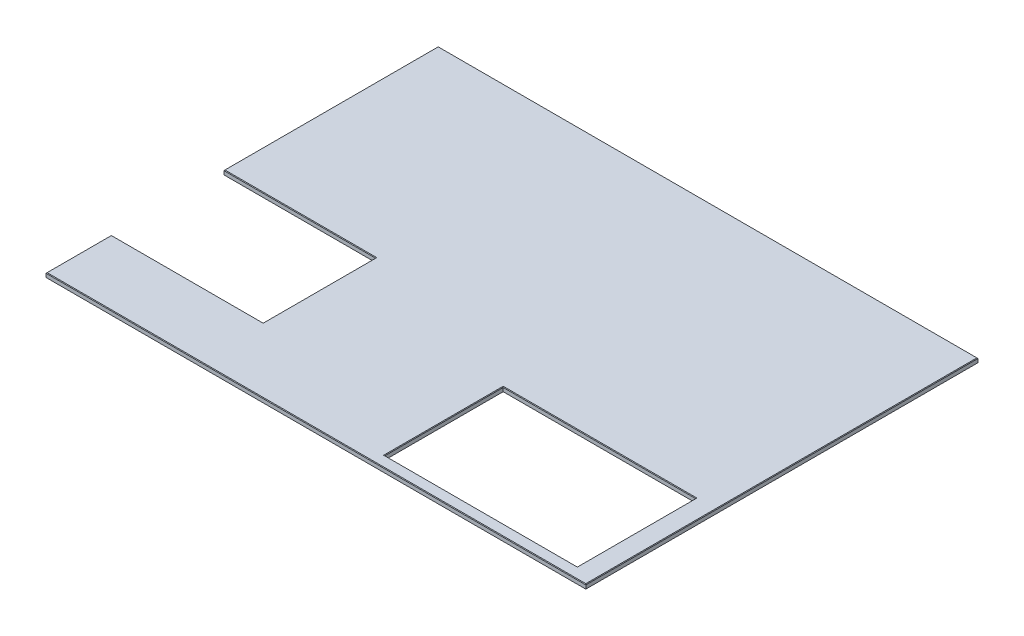
ISO-10303-21;
HEADER;
FILE_DESCRIPTION(('STEP AP214'),'2;1');
FILE_NAME('part.step','',(''),(''),'','','');
FILE_SCHEMA(('AUTOMOTIVE_DESIGN { 1 0 10303 214 1 1 1 1 }'));
ENDSEC;
DATA;
#1=APPLICATION_CONTEXT('core data for automotive mechanical design processes');
#2=APPLICATION_PROTOCOL_DEFINITION('international standard','automotive_design',2000,#1);
#3=PRODUCT_CONTEXT('',#1,'mechanical');
#4=PRODUCT('Part','Part','',(#3));
#5=PRODUCT_RELATED_PRODUCT_CATEGORY('part','',(#4));
#6=PRODUCT_DEFINITION_FORMATION('','',#4);
#7=PRODUCT_DEFINITION_CONTEXT('part definition',#1,'design');
#8=PRODUCT_DEFINITION('design','',#6,#7);
#9=PRODUCT_DEFINITION_SHAPE('','',#8);
#10=(LENGTH_UNIT() NAMED_UNIT(*) SI_UNIT(.MILLI.,.METRE.));
#11=(NAMED_UNIT(*) PLANE_ANGLE_UNIT() SI_UNIT($,.RADIAN.));
#12=(NAMED_UNIT(*) SI_UNIT($,.STERADIAN.) SOLID_ANGLE_UNIT());
#13=UNCERTAINTY_MEASURE_WITH_UNIT(LENGTH_MEASURE(1.E-05),#10,'distance_accuracy_value','');
#14=(GEOMETRIC_REPRESENTATION_CONTEXT(3) GLOBAL_UNCERTAINTY_ASSIGNED_CONTEXT((#13)) GLOBAL_UNIT_ASSIGNED_CONTEXT((#10,
#11,#12)) REPRESENTATION_CONTEXT('',''));
#15=CARTESIAN_POINT('',(0.,0.,0.));
#16=DIRECTION('',(0.,0.,1.));
#17=DIRECTION('',(1.,0.,0.));
#18=AXIS2_PLACEMENT_3D('',#15,#16,#17);
#19=CARTESIAN_POINT('',(0.,-19.05,0.));
#20=DIRECTION('',(0.,0.,1.));
#21=DIRECTION('',(1.,0.,0.));
#22=AXIS2_PLACEMENT_3D('',#19,#20,#21);
#23=PLANE('',#22);
#24=DIRECTION('',(0.,1.,0.));
#25=VECTOR('',#24,1.);
#26=CARTESIAN_POINT('',(2438.4,-19.05,0.));
#27=LINE('',#26,#25);
#28=CARTESIAN_POINT('',(2438.4,-19.05,0.));
#29=VERTEX_POINT('',#28);
#30=CARTESIAN_POINT('',(2438.4,-2.54000000000021,0.));
#31=VERTEX_POINT('',#30);
#32=EDGE_CURVE('E228',#29,#31,#27,.T.);
#33=ORIENTED_EDGE('',*,*,#32,.T.);
#34=DIRECTION('',(-1.,0.,0.));
#35=VECTOR('',#34,1.);
#36=CARTESIAN_POINT('',(0.,-2.54000000000021,0.));
#37=LINE('',#36,#35);
#38=CARTESIAN_POINT('',(0.,-2.54000000000021,0.));
#39=VERTEX_POINT('',#38);
#40=EDGE_CURVE('E293',#31,#39,#37,.T.);
#41=ORIENTED_EDGE('',*,*,#40,.T.);
#42=DIRECTION('',(0.,1.,0.));
#43=VECTOR('',#42,1.);
#44=CARTESIAN_POINT('',(0.,-19.05,0.));
#45=LINE('',#44,#43);
#46=CARTESIAN_POINT('',(0.,-19.05,0.));
#47=VERTEX_POINT('',#46);
#48=EDGE_CURVE('E229',#47,#39,#45,.T.);
#49=ORIENTED_EDGE('',*,*,#48,.F.);
#50=DIRECTION('',(1.,0.,0.));
#51=VECTOR('',#50,1.);
#52=CARTESIAN_POINT('',(0.,-19.05,0.));
#53=LINE('',#52,#51);
#54=EDGE_CURVE('E201',#47,#29,#53,.T.);
#55=ORIENTED_EDGE('',*,*,#54,.T.);
#56=EDGE_LOOP('',(#33,#41,#49,#55));
#57=FACE_BOUND('',#56,.T.);
#58=ADVANCED_FACE('F40',(#57),#23,.T.);
#59=CARTESIAN_POINT('',(1.13148179390222E-13,-19.05,-295.275));
#60=DIRECTION('',(-1.,0.,0.));
#61=DIRECTION('',(0.,0.,1.));
#62=AXIS2_PLACEMENT_3D('',#59,#60,#61);
#63=PLANE('',#62);
#64=ORIENTED_EDGE('',*,*,#48,.T.);
#65=DIRECTION('',(0.,0.,-1.));
#66=VECTOR('',#65,1.);
#67=CARTESIAN_POINT('',(1.13148179390222E-13,-2.54000000000021,-295.275));
#68=LINE('',#67,#66);
#69=CARTESIAN_POINT('',(1.13148179390222E-13,-2.54000000000021,-295.275));
#70=VERTEX_POINT('',#69);
#71=EDGE_CURVE('E278',#39,#70,#68,.T.);
#72=ORIENTED_EDGE('',*,*,#71,.T.);
#73=DIRECTION('',(0.,1.,0.));
#74=VECTOR('',#73,1.);
#75=CARTESIAN_POINT('',(1.13148179390222E-13,-19.05,-295.275));
#76=LINE('',#75,#74);
#77=CARTESIAN_POINT('',(1.13148179390222E-13,-19.05,-295.275));
#78=VERTEX_POINT('',#77);
#79=EDGE_CURVE('E233',#78,#70,#76,.T.);
#80=ORIENTED_EDGE('',*,*,#79,.F.);
#81=DIRECTION('',(0.,0.,1.));
#82=VECTOR('',#81,1.);
#83=CARTESIAN_POINT('',(1.13148179390222E-13,-19.05,-295.275));
#84=LINE('',#83,#82);
#85=EDGE_CURVE('E225',#78,#47,#84,.T.);
#86=ORIENTED_EDGE('',*,*,#85,.T.);
#87=EDGE_LOOP('',(#64,#72,#80,#86));
#88=FACE_BOUND('',#87,.T.);
#89=ADVANCED_FACE('F351',(#88),#63,.T.);
#90=CARTESIAN_POINT('',(1.13148179390222E-13,-19.05,-295.275));
#91=DIRECTION('',(0.,0.,-1.));
#92=DIRECTION('',(-1.,0.,0.));
#93=AXIS2_PLACEMENT_3D('',#90,#91,#92);
#94=PLANE('',#93);
#95=ORIENTED_EDGE('',*,*,#79,.T.);
#96=DIRECTION('',(1.,0.,0.));
#97=VECTOR('',#96,1.);
#98=CARTESIAN_POINT('',(1.13148179390222E-13,-2.54000000000021,-295.275));
#99=LINE('',#98,#97);
#100=CARTESIAN_POINT('',(685.8,-2.54000000000021,-295.275));
#101=VERTEX_POINT('',#100);
#102=EDGE_CURVE('E281',#70,#101,#99,.T.);
#103=ORIENTED_EDGE('',*,*,#102,.T.);
#104=DIRECTION('',(0.,1.,0.));
#105=VECTOR('',#104,1.);
#106=CARTESIAN_POINT('',(685.8,-19.05,-295.275));
#107=LINE('',#106,#105);
#108=CARTESIAN_POINT('',(685.8,-19.05,-295.275));
#109=VERTEX_POINT('',#108);
#110=EDGE_CURVE('E236',#109,#101,#107,.T.);
#111=ORIENTED_EDGE('',*,*,#110,.F.);
#112=DIRECTION('',(-1.,0.,0.));
#113=VECTOR('',#112,1.);
#114=CARTESIAN_POINT('',(1.13148179390222E-13,-19.05,-295.275));
#115=LINE('',#114,#113);
#116=EDGE_CURVE('E222',#109,#78,#115,.T.);
#117=ORIENTED_EDGE('',*,*,#116,.T.);
#118=EDGE_LOOP('',(#95,#103,#111,#117));
#119=FACE_BOUND('',#118,.T.);
#120=ADVANCED_FACE('F358',(#119),#94,.T.);
#121=CARTESIAN_POINT('',(685.8,-19.05,-803.275));
#122=DIRECTION('',(-1.,0.,0.));
#123=DIRECTION('',(0.,0.,1.));
#124=AXIS2_PLACEMENT_3D('',#121,#122,#123);
#125=PLANE('',#124);
#126=ORIENTED_EDGE('',*,*,#110,.T.);
#127=DIRECTION('',(0.,0.,-1.));
#128=VECTOR('',#127,1.);
#129=CARTESIAN_POINT('',(685.8,-2.54000000000021,-803.275));
#130=LINE('',#129,#128);
#131=CARTESIAN_POINT('',(685.8,-2.54000000000021,-803.275));
#132=VERTEX_POINT('',#131);
#133=EDGE_CURVE('E283',#101,#132,#130,.T.);
#134=ORIENTED_EDGE('',*,*,#133,.T.);
#135=DIRECTION('',(0.,1.,0.));
#136=VECTOR('',#135,1.);
#137=CARTESIAN_POINT('',(685.8,-19.05,-803.275));
#138=LINE('',#137,#136);
#139=CARTESIAN_POINT('',(685.8,-19.05,-803.275));
#140=VERTEX_POINT('',#139);
#141=EDGE_CURVE('E239',#140,#132,#138,.T.);
#142=ORIENTED_EDGE('',*,*,#141,.F.);
#143=DIRECTION('',(0.,0.,1.));
#144=VECTOR('',#143,1.);
#145=CARTESIAN_POINT('',(685.8,-19.05,-803.275));
#146=LINE('',#145,#144);
#147=EDGE_CURVE('E219',#140,#109,#146,.T.);
#148=ORIENTED_EDGE('',*,*,#147,.T.);
#149=EDGE_LOOP('',(#126,#134,#142,#148));
#150=FACE_BOUND('',#149,.T.);
#151=ADVANCED_FACE('F555',(#150),#125,.T.);
#152=CARTESIAN_POINT('',(0.,-19.05,-803.275));
#153=DIRECTION('',(0.,0.,1.));
#154=DIRECTION('',(1.,0.,0.));
#155=AXIS2_PLACEMENT_3D('',#152,#153,#154);
#156=PLANE('',#155);
#157=ORIENTED_EDGE('',*,*,#141,.T.);
#158=DIRECTION('',(-1.,0.,0.));
#159=VECTOR('',#158,1.);
#160=CARTESIAN_POINT('',(0.,-2.54000000000021,-803.275));
#161=LINE('',#160,#159);
#162=CARTESIAN_POINT('',(0.,-2.54000000000021,-803.275));
#163=VERTEX_POINT('',#162);
#164=EDGE_CURVE('E285',#132,#163,#161,.T.);
#165=ORIENTED_EDGE('',*,*,#164,.T.);
#166=DIRECTION('',(0.,1.,0.));
#167=VECTOR('',#166,1.);
#168=CARTESIAN_POINT('',(0.,-19.05,-803.275));
#169=LINE('',#168,#167);
#170=CARTESIAN_POINT('',(0.,-19.05,-803.275));
#171=VERTEX_POINT('',#170);
#172=EDGE_CURVE('E242',#171,#163,#169,.T.);
#173=ORIENTED_EDGE('',*,*,#172,.F.);
#174=DIRECTION('',(1.,0.,0.));
#175=VECTOR('',#174,1.);
#176=CARTESIAN_POINT('',(0.,-19.05,-803.275));
#177=LINE('',#176,#175);
#178=EDGE_CURVE('E216',#171,#140,#177,.T.);
#179=ORIENTED_EDGE('',*,*,#178,.T.);
#180=EDGE_LOOP('',(#157,#165,#173,#179));
#181=FACE_BOUND('',#180,.T.);
#182=ADVANCED_FACE('F545',(#181),#156,.T.);
#183=CARTESIAN_POINT('',(0.,-19.05,-1771.65));
#184=DIRECTION('',(-1.,0.,0.));
#185=DIRECTION('',(0.,0.,1.));
#186=AXIS2_PLACEMENT_3D('',#183,#184,#185);
#187=PLANE('',#186);
#188=ORIENTED_EDGE('',*,*,#172,.T.);
#189=DIRECTION('',(0.,0.,-1.));
#190=VECTOR('',#189,1.);
#191=CARTESIAN_POINT('',(0.,-2.54000000000021,-1771.65));
#192=LINE('',#191,#190);
#193=CARTESIAN_POINT('',(0.,-2.54000000000021,-1771.65));
#194=VERTEX_POINT('',#193);
#195=EDGE_CURVE('E287',#163,#194,#192,.T.);
#196=ORIENTED_EDGE('',*,*,#195,.T.);
#197=DIRECTION('',(0.,1.,0.));
#198=VECTOR('',#197,1.);
#199=CARTESIAN_POINT('',(0.,-19.05,-1771.65));
#200=LINE('',#199,#198);
#201=CARTESIAN_POINT('',(0.,-19.05,-1771.65));
#202=VERTEX_POINT('',#201);
#203=EDGE_CURVE('E245',#202,#194,#200,.T.);
#204=ORIENTED_EDGE('',*,*,#203,.F.);
#205=DIRECTION('',(0.,0.,1.));
#206=VECTOR('',#205,1.);
#207=CARTESIAN_POINT('',(0.,-19.05,-1771.65));
#208=LINE('',#207,#206);
#209=EDGE_CURVE('E213',#202,#171,#208,.T.);
#210=ORIENTED_EDGE('',*,*,#209,.T.);
#211=EDGE_LOOP('',(#188,#196,#204,#210));
#212=FACE_BOUND('',#211,.T.);
#213=ADVANCED_FACE('F536',(#212),#187,.T.);
#214=CARTESIAN_POINT('',(2438.4,-19.05,-1771.65));
#215=DIRECTION('',(0.,0.,-1.));
#216=DIRECTION('',(-1.,0.,0.));
#217=AXIS2_PLACEMENT_3D('',#214,#215,#216);
#218=PLANE('',#217);
#219=ORIENTED_EDGE('',*,*,#203,.T.);
#220=DIRECTION('',(1.,0.,0.));
#221=VECTOR('',#220,1.);
#222=CARTESIAN_POINT('',(2438.4,-2.54000000000021,-1771.65));
#223=LINE('',#222,#221);
#224=CARTESIAN_POINT('',(2438.4,-2.54000000000021,-1771.65));
#225=VERTEX_POINT('',#224);
#226=EDGE_CURVE('E289',#194,#225,#223,.T.);
#227=ORIENTED_EDGE('',*,*,#226,.T.);
#228=DIRECTION('',(0.,1.,0.));
#229=VECTOR('',#228,1.);
#230=CARTESIAN_POINT('',(2438.4,-19.05,-1771.65));
#231=LINE('',#230,#229);
#232=CARTESIAN_POINT('',(2438.4,-19.05,-1771.65));
#233=VERTEX_POINT('',#232);
#234=EDGE_CURVE('E248',#233,#225,#231,.T.);
#235=ORIENTED_EDGE('',*,*,#234,.F.);
#236=DIRECTION('',(-1.,0.,0.));
#237=VECTOR('',#236,1.);
#238=CARTESIAN_POINT('',(2438.4,-19.05,-1771.65));
#239=LINE('',#238,#237);
#240=EDGE_CURVE('E210',#233,#202,#239,.T.);
#241=ORIENTED_EDGE('',*,*,#240,.T.);
#242=EDGE_LOOP('',(#219,#227,#235,#241));
#243=FACE_BOUND('',#242,.T.);
#244=ADVANCED_FACE('F527',(#243),#218,.T.);
#245=CARTESIAN_POINT('',(2438.4,-19.05,0.));
#246=DIRECTION('',(1.,0.,0.));
#247=DIRECTION('',(0.,0.,-1.));
#248=AXIS2_PLACEMENT_3D('',#245,#246,#247);
#249=PLANE('',#248);
#250=ORIENTED_EDGE('',*,*,#234,.T.);
#251=DIRECTION('',(0.,0.,1.));
#252=VECTOR('',#251,1.);
#253=CARTESIAN_POINT('',(2438.4,-2.54000000000021,0.));
#254=LINE('',#253,#252);
#255=EDGE_CURVE('E291',#225,#31,#254,.T.);
#256=ORIENTED_EDGE('',*,*,#255,.T.);
#257=ORIENTED_EDGE('',*,*,#32,.F.);
#258=DIRECTION('',(0.,0.,-1.));
#259=VECTOR('',#258,1.);
#260=CARTESIAN_POINT('',(2438.4,-19.05,0.));
#261=LINE('',#260,#259);
#262=EDGE_CURVE('E207',#29,#233,#261,.T.);
#263=ORIENTED_EDGE('',*,*,#262,.T.);
#264=EDGE_LOOP('',(#250,#256,#257,#263));
#265=FACE_BOUND('',#264,.T.);
#266=ADVANCED_FACE('F363',(#265),#249,.T.);
#267=CARTESIAN_POINT('',(0.,-19.05,0.));
#268=DIRECTION('',(0.,1.,0.));
#269=DIRECTION('',(0.,0.,1.));
#270=AXIS2_PLACEMENT_3D('',#267,#268,#269);
#271=PLANE('',#270);
#272=DIRECTION('',(0.,0.,-1.));
#273=VECTOR('',#272,1.);
#274=CARTESIAN_POINT('',(2349.4365,-19.05,-585.724));
#275=LINE('',#274,#273);
#276=CARTESIAN_POINT('',(2349.4365,-19.05,-50.8));
#277=VERTEX_POINT('',#276);
#278=CARTESIAN_POINT('',(2349.4365,-19.05,-585.724));
#279=VERTEX_POINT('',#278);
#280=EDGE_CURVE('E178',#277,#279,#275,.T.);
#281=ORIENTED_EDGE('',*,*,#280,.T.);
#282=DIRECTION('',(-1.,0.,0.));
#283=VECTOR('',#282,1.);
#284=CARTESIAN_POINT('',(1479.4865,-19.05,-585.724));
#285=LINE('',#284,#283);
#286=CARTESIAN_POINT('',(1479.4865,-19.05,-585.724));
#287=VERTEX_POINT('',#286);
#288=EDGE_CURVE('E171',#279,#287,#285,.T.);
#289=ORIENTED_EDGE('',*,*,#288,.T.);
#290=DIRECTION('',(0.,0.,1.));
#291=VECTOR('',#290,1.);
#292=CARTESIAN_POINT('',(1479.4865,-19.05,-50.8));
#293=LINE('',#292,#291);
#294=CARTESIAN_POINT('',(1479.4865,-19.05,-50.8));
#295=VERTEX_POINT('',#294);
#296=EDGE_CURVE('E182',#287,#295,#293,.T.);
#297=ORIENTED_EDGE('',*,*,#296,.T.);
#298=DIRECTION('',(1.,0.,0.));
#299=VECTOR('',#298,1.);
#300=CARTESIAN_POINT('',(1479.4865,-19.05,-50.8));
#301=LINE('',#300,#299);
#302=EDGE_CURVE('E186',#295,#277,#301,.T.);
#303=ORIENTED_EDGE('',*,*,#302,.T.);
#304=EDGE_LOOP('',(#281,#289,#297,#303));
#305=FACE_BOUND('',#304,.T.);
#306=ORIENTED_EDGE('',*,*,#54,.F.);
#307=ORIENTED_EDGE('',*,*,#85,.F.);
#308=ORIENTED_EDGE('',*,*,#116,.F.);
#309=ORIENTED_EDGE('',*,*,#147,.F.);
#310=ORIENTED_EDGE('',*,*,#178,.F.);
#311=ORIENTED_EDGE('',*,*,#209,.F.);
#312=ORIENTED_EDGE('',*,*,#240,.F.);
#313=ORIENTED_EDGE('',*,*,#262,.F.);
#314=EDGE_LOOP('',(#306,#307,#308,#309,#310,#311,#312,#313));
#315=FACE_BOUND('',#314,.T.);
#316=ADVANCED_FACE('F188',(#305,#315),#271,.F.);
#317=CARTESIAN_POINT('',(0.,0.,0.));
#318=DIRECTION('',(0.,1.,0.));
#319=DIRECTION('',(0.,0.,1.));
#320=AXIS2_PLACEMENT_3D('',#317,#318,#319);
#321=PLANE('',#320);
#322=DIRECTION('',(-1.,0.,0.));
#323=VECTOR('',#322,1.);
#324=CARTESIAN_POINT('',(0.,0.,-292.735));
#325=LINE('',#324,#323);
#326=CARTESIAN_POINT('',(688.34,0.,-292.735));
#327=VERTEX_POINT('',#326);
#328=CARTESIAN_POINT('',(2.54000000000032,0.,-292.735));
#329=VERTEX_POINT('',#328);
#330=EDGE_CURVE('E273',#327,#329,#325,.T.);
#331=ORIENTED_EDGE('',*,*,#330,.T.);
#332=DIRECTION('',(0.,0.,1.));
#333=VECTOR('',#332,1.);
#334=CARTESIAN_POINT('',(2.54000000000021,0.,0.));
#335=LINE('',#334,#333);
#336=CARTESIAN_POINT('',(2.54000000000021,0.,-2.54000000000021));
#337=VERTEX_POINT('',#336);
#338=EDGE_CURVE('E275',#329,#337,#335,.T.);
#339=ORIENTED_EDGE('',*,*,#338,.T.);
#340=DIRECTION('',(1.,0.,0.));
#341=VECTOR('',#340,1.);
#342=CARTESIAN_POINT('',(0.,0.,-2.54000000000021));
#343=LINE('',#342,#341);
#344=CARTESIAN_POINT('',(2435.86,0.,-2.54000000000021));
#345=VERTEX_POINT('',#344);
#346=EDGE_CURVE('E261',#337,#345,#343,.T.);
#347=ORIENTED_EDGE('',*,*,#346,.T.);
#348=DIRECTION('',(0.,0.,-1.));
#349=VECTOR('',#348,1.);
#350=CARTESIAN_POINT('',(2435.86,0.,-6.10582870603885E-13));
#351=LINE('',#350,#349);
#352=CARTESIAN_POINT('',(2435.86,0.,-1769.11));
#353=VERTEX_POINT('',#352);
#354=EDGE_CURVE('E263',#345,#353,#351,.T.);
#355=ORIENTED_EDGE('',*,*,#354,.T.);
#356=DIRECTION('',(-1.,0.,0.));
#357=VECTOR('',#356,1.);
#358=CARTESIAN_POINT('',(-1.61097986802379E-13,0.,-1769.11));
#359=LINE('',#358,#357);
#360=CARTESIAN_POINT('',(2.54000000000021,0.,-1769.11));
#361=VERTEX_POINT('',#360);
#362=EDGE_CURVE('E265',#353,#361,#359,.T.);
#363=ORIENTED_EDGE('',*,*,#362,.T.);
#364=DIRECTION('',(0.,0.,1.));
#365=VECTOR('',#364,1.);
#366=CARTESIAN_POINT('',(2.5400000000003,0.,0.));
#367=LINE('',#366,#365);
#368=CARTESIAN_POINT('',(2.54000000000026,0.,-805.815));
#369=VERTEX_POINT('',#368);
#370=EDGE_CURVE('E267',#361,#369,#367,.T.);
#371=ORIENTED_EDGE('',*,*,#370,.T.);
#372=DIRECTION('',(1.,0.,0.));
#373=VECTOR('',#372,1.);
#374=CARTESIAN_POINT('',(0.,0.,-805.815));
#375=LINE('',#374,#373);
#376=CARTESIAN_POINT('',(688.34,0.,-805.815));
#377=VERTEX_POINT('',#376);
#378=EDGE_CURVE('E269',#369,#377,#375,.T.);
#379=ORIENTED_EDGE('',*,*,#378,.T.);
#380=DIRECTION('',(0.,0.,1.));
#381=VECTOR('',#380,1.);
#382=CARTESIAN_POINT('',(688.34,0.,-1.50435219836709E-13));
#383=LINE('',#382,#381);
#384=EDGE_CURVE('E271',#377,#327,#383,.T.);
#385=ORIENTED_EDGE('',*,*,#384,.T.);
#386=EDGE_LOOP('',(#331,#339,#347,#355,#363,#371,#379,#385));
#387=FACE_BOUND('',#386,.T.);
#388=DIRECTION('',(-1.,0.,0.));
#389=VECTOR('',#388,1.);
#390=CARTESIAN_POINT('',(1479.4865,0.,-48.2599999999998));
#391=LINE('',#390,#389);
#392=CARTESIAN_POINT('',(2351.9765,0.,-48.2599999999997));
#393=VERTEX_POINT('',#392);
#394=CARTESIAN_POINT('',(1476.9465,0.,-48.2599999999998));
#395=VERTEX_POINT('',#394);
#396=EDGE_CURVE('E256',#393,#395,#391,.T.);
#397=ORIENTED_EDGE('',*,*,#396,.T.);
#398=DIRECTION('',(0.,0.,-1.));
#399=VECTOR('',#398,1.);
#400=CARTESIAN_POINT('',(1476.9465,0.,-585.724));
#401=LINE('',#400,#399);
#402=CARTESIAN_POINT('',(1476.9465,0.,-588.264));
#403=VERTEX_POINT('',#402);
#404=EDGE_CURVE('E258',#395,#403,#401,.T.);
#405=ORIENTED_EDGE('',*,*,#404,.T.);
#406=DIRECTION('',(1.,0.,0.));
#407=VECTOR('',#406,1.);
#408=CARTESIAN_POINT('',(2349.4365,0.,-588.264));
#409=LINE('',#408,#407);
#410=CARTESIAN_POINT('',(2351.9765,0.,-588.264));
#411=VERTEX_POINT('',#410);
#412=EDGE_CURVE('E232',#403,#411,#409,.T.);
#413=ORIENTED_EDGE('',*,*,#412,.T.);
#414=DIRECTION('',(0.,0.,1.));
#415=VECTOR('',#414,1.);
#416=CARTESIAN_POINT('',(2351.9765,0.,-50.8));
#417=LINE('',#416,#415);
#418=EDGE_CURVE('E254',#411,#393,#417,.T.);
#419=ORIENTED_EDGE('',*,*,#418,.T.);
#420=EDGE_LOOP('',(#397,#405,#413,#419));
#421=FACE_BOUND('',#420,.T.);
#422=ADVANCED_FACE('F333',(#387,#421),#321,.T.);
#423=CARTESIAN_POINT('',(1479.4865,-19.05,-585.724));
#424=DIRECTION('',(0.,0.,-1.));
#425=DIRECTION('',(-1.,0.,0.));
#426=AXIS2_PLACEMENT_3D('',#423,#424,#425);
#427=PLANE('',#426);
#428=DIRECTION('',(0.,1.,0.));
#429=VECTOR('',#428,1.);
#430=CARTESIAN_POINT('',(2349.4365,-19.05,-585.724));
#431=LINE('',#430,#429);
#432=CARTESIAN_POINT('',(2349.4365,-2.54000000000021,-585.724));
#433=VERTEX_POINT('',#432);
#434=EDGE_CURVE('E199',#279,#433,#431,.T.);
#435=ORIENTED_EDGE('',*,*,#434,.T.);
#436=DIRECTION('',(-1.,0.,0.));
#437=VECTOR('',#436,1.);
#438=CARTESIAN_POINT('',(1479.4865,-2.54000000000021,-585.724));
#439=LINE('',#438,#437);
#440=CARTESIAN_POINT('',(1479.4865,-2.54000000000021,-585.724));
#441=VERTEX_POINT('',#440);
#442=EDGE_CURVE('E11',#433,#441,#439,.T.);
#443=ORIENTED_EDGE('',*,*,#442,.T.);
#444=DIRECTION('',(0.,1.,0.));
#445=VECTOR('',#444,1.);
#446=CARTESIAN_POINT('',(1479.4865,-19.05,-585.724));
#447=LINE('',#446,#445);
#448=EDGE_CURVE('E167',#287,#441,#447,.T.);
#449=ORIENTED_EDGE('',*,*,#448,.F.);
#450=ORIENTED_EDGE('',*,*,#288,.F.);
#451=EDGE_LOOP('',(#435,#443,#449,#450));
#452=FACE_BOUND('',#451,.T.);
#453=ADVANCED_FACE('F169',(#452),#427,.F.);
#454=CARTESIAN_POINT('',(2349.4365,-19.05,-585.724));
#455=DIRECTION('',(1.,0.,0.));
#456=DIRECTION('',(0.,0.,-1.));
#457=AXIS2_PLACEMENT_3D('',#454,#455,#456);
#458=PLANE('',#457);
#459=DIRECTION('',(0.,1.,0.));
#460=VECTOR('',#459,1.);
#461=CARTESIAN_POINT('',(2349.4365,-19.05,-50.8));
#462=LINE('',#461,#460);
#463=CARTESIAN_POINT('',(2349.4365,-2.54000000000021,-50.8));
#464=VERTEX_POINT('',#463);
#465=EDGE_CURVE('E202',#277,#464,#462,.T.);
#466=ORIENTED_EDGE('',*,*,#465,.T.);
#467=DIRECTION('',(0.,0.,-1.));
#468=VECTOR('',#467,1.);
#469=CARTESIAN_POINT('',(2349.4365,-2.54000000000021,-585.724));
#470=LINE('',#469,#468);
#471=EDGE_CURVE('E50',#464,#433,#470,.T.);
#472=ORIENTED_EDGE('',*,*,#471,.T.);
#473=ORIENTED_EDGE('',*,*,#434,.F.);
#474=ORIENTED_EDGE('',*,*,#280,.F.);
#475=EDGE_LOOP('',(#466,#472,#473,#474));
#476=FACE_BOUND('',#475,.T.);
#477=ADVANCED_FACE('F341',(#476),#458,.F.);
#478=CARTESIAN_POINT('',(1479.4865,-19.05,-50.8));
#479=DIRECTION('',(0.,0.,1.));
#480=DIRECTION('',(1.,0.,0.));
#481=AXIS2_PLACEMENT_3D('',#478,#479,#480);
#482=PLANE('',#481);
#483=DIRECTION('',(0.,1.,0.));
#484=VECTOR('',#483,1.);
#485=CARTESIAN_POINT('',(1479.4865,-19.05,-50.8));
#486=LINE('',#485,#484);
#487=CARTESIAN_POINT('',(1479.4865,-2.54000000000021,-50.8));
#488=VERTEX_POINT('',#487);
#489=EDGE_CURVE('E177',#295,#488,#486,.T.);
#490=ORIENTED_EDGE('',*,*,#489,.T.);
#491=DIRECTION('',(1.,0.,0.));
#492=VECTOR('',#491,1.);
#493=CARTESIAN_POINT('',(2349.4365,-2.54000000000021,-50.8));
#494=LINE('',#493,#492);
#495=EDGE_CURVE('E65',#488,#464,#494,.T.);
#496=ORIENTED_EDGE('',*,*,#495,.T.);
#497=ORIENTED_EDGE('',*,*,#465,.F.);
#498=ORIENTED_EDGE('',*,*,#302,.F.);
#499=EDGE_LOOP('',(#490,#496,#497,#498));
#500=FACE_BOUND('',#499,.T.);
#501=ADVANCED_FACE('F340',(#500),#482,.F.);
#502=CARTESIAN_POINT('',(1479.4865,-19.05,-50.8));
#503=DIRECTION('',(-1.,0.,0.));
#504=DIRECTION('',(0.,0.,1.));
#505=AXIS2_PLACEMENT_3D('',#502,#503,#504);
#506=PLANE('',#505);
#507=ORIENTED_EDGE('',*,*,#448,.T.);
#508=DIRECTION('',(0.,0.,1.));
#509=VECTOR('',#508,1.);
#510=CARTESIAN_POINT('',(1479.4865,-2.54000000000021,-50.8));
#511=LINE('',#510,#509);
#512=EDGE_CURVE('E295',#441,#488,#511,.T.);
#513=ORIENTED_EDGE('',*,*,#512,.T.);
#514=ORIENTED_EDGE('',*,*,#489,.F.);
#515=ORIENTED_EDGE('',*,*,#296,.F.);
#516=EDGE_LOOP('',(#507,#513,#514,#515));
#517=FACE_BOUND('',#516,.T.);
#518=ADVANCED_FACE('F183',(#517),#506,.F.);
#519=CARTESIAN_POINT('',(2.5400000000003,0.,0.));
#520=DIRECTION('',(0.707106781186547,-0.707106781186547,0.));
#521=DIRECTION('',(0.,0.,1.));
#522=AXIS2_PLACEMENT_3D('',#519,#520,#521);
#523=PLANE('',#522);
#524=DIRECTION('',(0.577350269189643,0.577350269189643,0.577350269189592));
#525=VECTOR('',#524,1.);
#526=CARTESIAN_POINT('',(1.69333333333337,-0.846666666666839,-1769.95666666667));
#527=LINE('',#526,#525);
#528=EDGE_CURVE('E194',#194,#361,#527,.T.);
#529=ORIENTED_EDGE('',*,*,#528,.F.);
#530=ORIENTED_EDGE('',*,*,#195,.F.);
#531=DIRECTION('',(0.577350269189626,0.577350269189626,-0.577350269189626));
#532=VECTOR('',#531,1.);
#533=CARTESIAN_POINT('',(-266.065,-268.605,-537.21));
#534=LINE('',#533,#532);
#535=EDGE_CURVE('E191',#369,#163,#534,.F.);
#536=ORIENTED_EDGE('',*,*,#535,.F.);
#537=ORIENTED_EDGE('',*,*,#370,.F.);
#538=EDGE_LOOP('',(#529,#530,#536,#537));
#539=FACE_BOUND('',#538,.T.);
#540=ADVANCED_FACE('F414',(#539),#523,.F.);
#541=CARTESIAN_POINT('',(0.,0.,-805.815));
#542=DIRECTION('',(0.,-0.707106781186547,-0.707106781186547));
#543=DIRECTION('',(1.,0.,0.));
#544=AXIS2_PLACEMENT_3D('',#541,#542,#543);
#545=PLANE('',#544);
#546=ORIENTED_EDGE('',*,*,#535,.T.);
#547=ORIENTED_EDGE('',*,*,#164,.F.);
#548=DIRECTION('',(0.577350269189633,0.577350269189622,-0.577350269189622));
#549=VECTOR('',#548,1.);
#550=CARTESIAN_POINT('',(419.734999999999,-268.604999999997,-537.210000000003));
#551=LINE('',#550,#549);
#552=EDGE_CURVE('E312',#377,#132,#551,.F.);
#553=ORIENTED_EDGE('',*,*,#552,.F.);
#554=ORIENTED_EDGE('',*,*,#378,.F.);
#555=EDGE_LOOP('',(#546,#547,#553,#554));
#556=FACE_BOUND('',#555,.T.);
#557=ADVANCED_FACE('F407',(#556),#545,.F.);
#558=CARTESIAN_POINT('',(-1.61097986802379E-13,0.,-1769.11));
#559=DIRECTION('',(0.,-0.707106781186517,0.707106781186579));
#560=DIRECTION('',(-1.,0.,0.));
#561=AXIS2_PLACEMENT_3D('',#558,#559,#560);
#562=PLANE('',#561);
#563=ORIENTED_EDGE('',*,*,#528,.T.);
#564=ORIENTED_EDGE('',*,*,#362,.F.);
#565=DIRECTION('',(-0.57735026918971,0.577350269189609,0.577350269189558));
#566=VECTOR('',#565,1.);
#567=CARTESIAN_POINT('',(1846.15666666665,589.703333333247,-1179.4066666668));
#568=LINE('',#567,#566);
#569=EDGE_CURVE('E309',#225,#353,#568,.T.);
#570=ORIENTED_EDGE('',*,*,#569,.F.);
#571=ORIENTED_EDGE('',*,*,#226,.F.);
#572=EDGE_LOOP('',(#563,#564,#570,#571));
#573=FACE_BOUND('',#572,.T.);
#574=ADVANCED_FACE('F400',(#573),#562,.F.);
#575=CARTESIAN_POINT('',(688.34,0.,-1.50435219836709E-13));
#576=DIRECTION('',(0.707106781186541,-0.707106781186554,0.));
#577=DIRECTION('',(0.,0.,1.));
#578=AXIS2_PLACEMENT_3D('',#575,#576,#577);
#579=PLANE('',#578);
#580=ORIENTED_EDGE('',*,*,#552,.T.);
#581=ORIENTED_EDGE('',*,*,#133,.F.);
#582=DIRECTION('',(0.577350269189633,0.577350269189622,0.577350269189622));
#583=VECTOR('',#582,1.);
#584=CARTESIAN_POINT('',(458.893333333328,-229.446666666668,-522.181666666668));
#585=LINE('',#584,#583);
#586=EDGE_CURVE('E306',#327,#101,#585,.F.);
#587=ORIENTED_EDGE('',*,*,#586,.F.);
#588=ORIENTED_EDGE('',*,*,#384,.F.);
#589=EDGE_LOOP('',(#580,#581,#587,#588));
#590=FACE_BOUND('',#589,.T.);
#591=ADVANCED_FACE('F393',(#590),#579,.F.);
#592=CARTESIAN_POINT('',(2435.86,0.,-6.10582870603885E-13));
#593=DIRECTION('',(-0.707106781186486,-0.707106781186609,0.));
#594=DIRECTION('',(0.,0.,-1.));
#595=AXIS2_PLACEMENT_3D('',#592,#593,#594);
#596=PLANE('',#595);
#597=ORIENTED_EDGE('',*,*,#569,.T.);
#598=ORIENTED_EDGE('',*,*,#354,.F.);
#599=DIRECTION('',(-0.577350269189693,0.577350269189592,-0.577350269189592));
#600=VECTOR('',#599,1.);
#601=CARTESIAN_POINT('',(1623.90666666648,811.95333333338,-814.493333333381));
#602=LINE('',#601,#600);
#603=EDGE_CURVE('E303',#31,#345,#602,.T.);
#604=ORIENTED_EDGE('',*,*,#603,.F.);
#605=ORIENTED_EDGE('',*,*,#255,.F.);
#606=EDGE_LOOP('',(#597,#598,#604,#605));
#607=FACE_BOUND('',#606,.T.);
#608=ADVANCED_FACE('F386',(#607),#596,.F.);
#609=CARTESIAN_POINT('',(0.,0.,-292.735));
#610=DIRECTION('',(0.,-0.707106781186547,0.707106781186547));
#611=DIRECTION('',(-1.,0.,0.));
#612=AXIS2_PLACEMENT_3D('',#609,#610,#611);
#613=PLANE('',#612);
#614=ORIENTED_EDGE('',*,*,#586,.T.);
#615=ORIENTED_EDGE('',*,*,#102,.F.);
#616=DIRECTION('',(0.577350269189626,0.577350269189626,0.577350269189626));
#617=VECTOR('',#616,1.);
#618=CARTESIAN_POINT('',(1.69333333333356,-0.846666666666766,-293.581666666667));
#619=LINE('',#618,#617);
#620=EDGE_CURVE('E301',#329,#70,#619,.F.);
#621=ORIENTED_EDGE('',*,*,#620,.F.);
#622=ORIENTED_EDGE('',*,*,#330,.F.);
#623=EDGE_LOOP('',(#614,#615,#621,#622));
#624=FACE_BOUND('',#623,.T.);
#625=ADVANCED_FACE('F379',(#624),#613,.F.);
#626=CARTESIAN_POINT('',(0.,0.,-2.54000000000021));
#627=DIRECTION('',(0.,-0.707106781186547,-0.707106781186547));
#628=DIRECTION('',(1.,0.,0.));
#629=AXIS2_PLACEMENT_3D('',#626,#627,#628);
#630=PLANE('',#629);
#631=ORIENTED_EDGE('',*,*,#603,.T.);
#632=ORIENTED_EDGE('',*,*,#346,.F.);
#633=DIRECTION('',(-0.577350269189626,-0.577350269189626,0.577350269189626));
#634=VECTOR('',#633,1.);
#635=CARTESIAN_POINT('',(1.69333333333347,-0.846666666666737,-1.69333333333347));
#636=LINE('',#635,#634);
#637=EDGE_CURVE('E299',#39,#337,#636,.F.);
#638=ORIENTED_EDGE('',*,*,#637,.F.);
#639=ORIENTED_EDGE('',*,*,#40,.F.);
#640=EDGE_LOOP('',(#631,#632,#638,#639));
#641=FACE_BOUND('',#640,.T.);
#642=ADVANCED_FACE('F372',(#641),#630,.F.);
#643=CARTESIAN_POINT('',(2.54000000000021,0.,0.));
#644=DIRECTION('',(0.707106781186547,-0.707106781186547,0.));
#645=DIRECTION('',(0.,0.,1.));
#646=AXIS2_PLACEMENT_3D('',#643,#644,#645);
#647=PLANE('',#646);
#648=ORIENTED_EDGE('',*,*,#620,.T.);
#649=ORIENTED_EDGE('',*,*,#71,.F.);
#650=ORIENTED_EDGE('',*,*,#637,.T.);
#651=ORIENTED_EDGE('',*,*,#338,.F.);
#652=EDGE_LOOP('',(#648,#649,#650,#651));
#653=FACE_BOUND('',#652,.T.);
#654=ADVANCED_FACE('F366',(#653),#647,.F.);
#655=CARTESIAN_POINT('',(2349.4365,-2.54000000000021,-585.724));
#656=DIRECTION('',(-0.707106781186547,0.707106781186547,0.));
#657=DIRECTION('',(0.,0.,1.));
#658=AXIS2_PLACEMENT_3D('',#655,#656,#657);
#659=PLANE('',#658);
#660=DIRECTION('',(0.577350269189626,0.577350269189626,0.577350269189626));
#661=VECTOR('',#660,1.);
#662=CARTESIAN_POINT('',(2059.45316666667,-292.523333333333,-340.783333333333));
#663=LINE('',#662,#661);
#664=EDGE_CURVE('E320',#393,#464,#663,.F.);
#665=ORIENTED_EDGE('',*,*,#664,.F.);
#666=ORIENTED_EDGE('',*,*,#418,.F.);
#667=DIRECTION('',(0.577350269189626,0.577350269189626,-0.577350269189626));
#668=VECTOR('',#667,1.);
#669=CARTESIAN_POINT('',(2349.4365,-2.54000000000021,-585.724));
#670=LINE('',#669,#668);
#671=EDGE_CURVE('E45',#433,#411,#670,.T.);
#672=ORIENTED_EDGE('',*,*,#671,.F.);
#673=ORIENTED_EDGE('',*,*,#471,.F.);
#674=EDGE_LOOP('',(#665,#666,#672,#673));
#675=FACE_BOUND('',#674,.T.);
#676=ADVANCED_FACE('F43',(#675),#659,.T.);
#677=CARTESIAN_POINT('',(1479.4865,-2.54000000000021,-585.724));
#678=DIRECTION('',(0.,0.707106781186547,0.707106781186547));
#679=DIRECTION('',(1.,0.,0.));
#680=AXIS2_PLACEMENT_3D('',#677,#678,#679);
#681=PLANE('',#680);
#682=ORIENTED_EDGE('',*,*,#671,.T.);
#683=ORIENTED_EDGE('',*,*,#412,.F.);
#684=DIRECTION('',(0.577350269189626,-0.577350269189626,0.577350269189626));
#685=VECTOR('',#684,1.);
#686=CARTESIAN_POINT('',(1657.7945,-180.848,-407.416));
#687=LINE('',#686,#685);
#688=EDGE_CURVE('E319',#441,#403,#687,.F.);
#689=ORIENTED_EDGE('',*,*,#688,.F.);
#690=ORIENTED_EDGE('',*,*,#442,.F.);
#691=EDGE_LOOP('',(#682,#683,#689,#690));
#692=FACE_BOUND('',#691,.T.);
#693=ADVANCED_FACE('F329',(#692),#681,.T.);
#694=CARTESIAN_POINT('',(1479.4865,-2.54000000000021,-50.8));
#695=DIRECTION('',(0.,0.707106781186548,-0.707106781186547));
#696=DIRECTION('',(-1.,0.,0.));
#697=AXIS2_PLACEMENT_3D('',#694,#695,#696);
#698=PLANE('',#697);
#699=ORIENTED_EDGE('',*,*,#664,.T.);
#700=ORIENTED_EDGE('',*,*,#495,.F.);
#701=DIRECTION('',(-0.577350269189626,0.577350269189626,0.577350269189626));
#702=VECTOR('',#701,1.);
#703=CARTESIAN_POINT('',(1479.4865,-2.54000000000021,-50.8));
#704=LINE('',#703,#702);
#705=EDGE_CURVE('E317',#395,#488,#704,.F.);
#706=ORIENTED_EDGE('',*,*,#705,.F.);
#707=ORIENTED_EDGE('',*,*,#396,.F.);
#708=EDGE_LOOP('',(#699,#700,#706,#707));
#709=FACE_BOUND('',#708,.T.);
#710=ADVANCED_FACE('F339',(#709),#698,.T.);
#711=CARTESIAN_POINT('',(1479.4865,-2.54000000000021,-50.8));
#712=DIRECTION('',(0.707106781186547,0.707106781186547,0.));
#713=DIRECTION('',(0.,0.,-1.));
#714=AXIS2_PLACEMENT_3D('',#711,#712,#713);
#715=PLANE('',#714);
#716=ORIENTED_EDGE('',*,*,#688,.T.);
#717=ORIENTED_EDGE('',*,*,#404,.F.);
#718=ORIENTED_EDGE('',*,*,#705,.T.);
#719=ORIENTED_EDGE('',*,*,#512,.F.);
#720=EDGE_LOOP('',(#716,#717,#718,#719));
#721=FACE_BOUND('',#720,.T.);
#722=ADVANCED_FACE('F337',(#721),#715,.T.);
#723=CLOSED_SHELL('',(#58,#89,#120,#151,#182,#213,#244,#266,#316,#422,#453,#477,#501,#518,#540,
#557,#574,#591,#608,#625,#642,#654,#676,#693,#710,#722));
#724=MANIFOLD_SOLID_BREP('B2',#723);
#725=ADVANCED_BREP_SHAPE_REPRESENTATION('',(#18,#724),#14);
#726=SHAPE_DEFINITION_REPRESENTATION(#9,#725);
ENDSEC;
END-ISO-10303-21;
